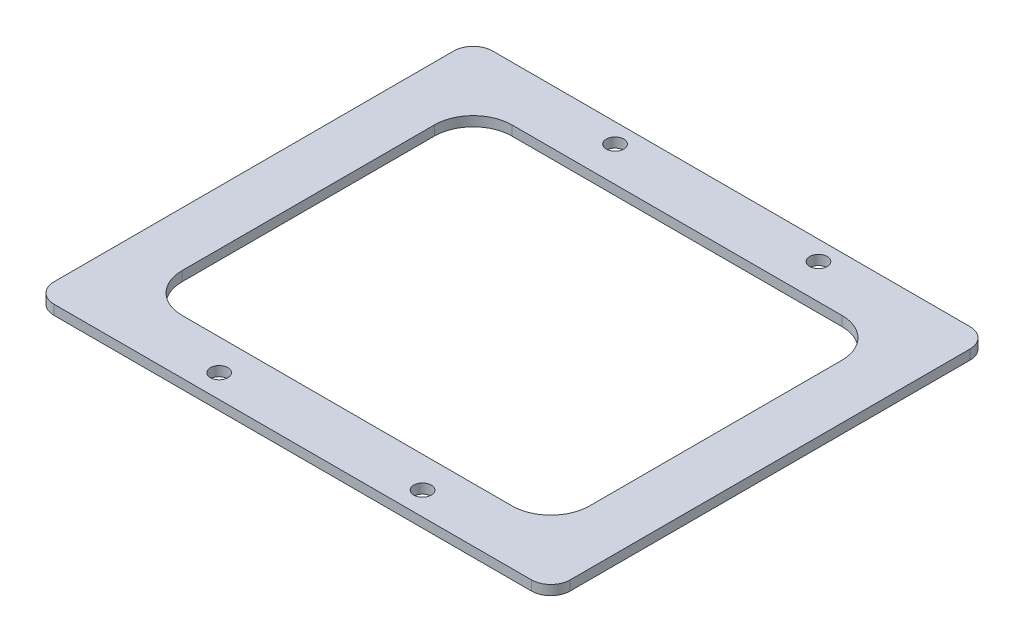
ISO-10303-21;
HEADER;
FILE_DESCRIPTION(('STEP AP214'),'2;1');
FILE_NAME('part.step','',(''),(''),'','','');
FILE_SCHEMA(('AUTOMOTIVE_DESIGN { 1 0 10303 214 1 1 1 1 }'));
ENDSEC;
DATA;
#1=APPLICATION_CONTEXT('core data for automotive mechanical design processes');
#2=APPLICATION_PROTOCOL_DEFINITION('international standard','automotive_design',2000,#1);
#3=PRODUCT_CONTEXT('',#1,'mechanical');
#4=PRODUCT('Part','Part','',(#3));
#5=PRODUCT_RELATED_PRODUCT_CATEGORY('part','',(#4));
#6=PRODUCT_DEFINITION_FORMATION('','',#4);
#7=PRODUCT_DEFINITION_CONTEXT('part definition',#1,'design');
#8=PRODUCT_DEFINITION('design','',#6,#7);
#9=PRODUCT_DEFINITION_SHAPE('','',#8);
#10=(LENGTH_UNIT() NAMED_UNIT(*) SI_UNIT(.MILLI.,.METRE.));
#11=(NAMED_UNIT(*) PLANE_ANGLE_UNIT() SI_UNIT($,.RADIAN.));
#12=(NAMED_UNIT(*) SI_UNIT($,.STERADIAN.) SOLID_ANGLE_UNIT());
#13=UNCERTAINTY_MEASURE_WITH_UNIT(LENGTH_MEASURE(1.E-05),#10,'distance_accuracy_value','');
#14=(GEOMETRIC_REPRESENTATION_CONTEXT(3) GLOBAL_UNCERTAINTY_ASSIGNED_CONTEXT((#13)) GLOBAL_UNIT_ASSIGNED_CONTEXT((#10,
#11,#12)) REPRESENTATION_CONTEXT('',''));
#15=CARTESIAN_POINT('',(0.,0.,0.));
#16=DIRECTION('',(0.,0.,1.));
#17=DIRECTION('',(1.,0.,0.));
#18=AXIS2_PLACEMENT_3D('',#15,#16,#17);
#19=CARTESIAN_POINT('',(0.,3.175,0.));
#20=DIRECTION('',(0.,-1.,0.));
#21=DIRECTION('',(0.,0.,-1.));
#22=AXIS2_PLACEMENT_3D('',#19,#20,#21);
#23=PLANE('',#22);
#24=CARTESIAN_POINT('',(34.8615,3.175,-65.405));
#25=DIRECTION('',(0.,1.,0.));
#26=DIRECTION('',(0.,0.,1.));
#27=AXIS2_PLACEMENT_3D('',#24,#25,#26);
#28=CIRCLE('',#27,2.8575);
#29=CARTESIAN_POINT('',(34.8615,3.175,-62.5475));
#30=VERTEX_POINT('',#29);
#31=EDGE_CURVE('E419',#30,#30,#28,.T.);
#32=ORIENTED_EDGE('',*,*,#31,.F.);
#33=EDGE_LOOP('',(#32));
#34=FACE_BOUND('',#33,.T.);
#35=CARTESIAN_POINT('',(-31.6865,3.175,-65.405));
#36=DIRECTION('',(0.,1.,0.));
#37=DIRECTION('',(0.,0.,1.));
#38=AXIS2_PLACEMENT_3D('',#35,#36,#37);
#39=CIRCLE('',#38,2.8575);
#40=CARTESIAN_POINT('',(-31.6865,3.175,-62.5475));
#41=VERTEX_POINT('',#40);
#42=EDGE_CURVE('E414',#41,#41,#39,.T.);
#43=ORIENTED_EDGE('',*,*,#42,.F.);
#44=EDGE_LOOP('',(#43));
#45=FACE_BOUND('',#44,.T.);
#46=DIRECTION('',(-1.,0.,0.));
#47=VECTOR('',#46,1.);
#48=CARTESIAN_POINT('',(84.455,3.175,-71.755));
#49=LINE('',#48,#47);
#50=CARTESIAN_POINT('',(78.105,3.175,-71.755));
#51=VERTEX_POINT('',#50);
#52=CARTESIAN_POINT('',(-78.105,3.175,-71.755));
#53=VERTEX_POINT('',#52);
#54=EDGE_CURVE('E381',#51,#53,#49,.T.);
#55=ORIENTED_EDGE('',*,*,#54,.T.);
#56=CARTESIAN_POINT('',(-78.105,3.175,-65.405));
#57=DIRECTION('',(0.,-1.,0.));
#58=DIRECTION('',(0.,0.,-1.));
#59=AXIS2_PLACEMENT_3D('',#56,#57,#58);
#60=CIRCLE('',#59,6.35);
#61=CARTESIAN_POINT('',(-84.455,3.175,-65.405));
#62=VERTEX_POINT('',#61);
#63=EDGE_CURVE('E199',#53,#62,#60,.F.);
#64=ORIENTED_EDGE('',*,*,#63,.T.);
#65=DIRECTION('',(0.,0.,1.));
#66=VECTOR('',#65,1.);
#67=CARTESIAN_POINT('',(-84.455,3.175,71.755));
#68=LINE('',#67,#66);
#69=CARTESIAN_POINT('',(-84.455,3.175,65.405));
#70=VERTEX_POINT('',#69);
#71=EDGE_CURVE('E168',#62,#70,#68,.T.);
#72=ORIENTED_EDGE('',*,*,#71,.T.);
#73=CARTESIAN_POINT('',(-78.105,3.175,65.405));
#74=DIRECTION('',(0.,-1.,0.));
#75=DIRECTION('',(0.,0.,-1.));
#76=AXIS2_PLACEMENT_3D('',#73,#74,#75);
#77=CIRCLE('',#76,6.35);
#78=CARTESIAN_POINT('',(-78.105,3.175,71.755));
#79=VERTEX_POINT('',#78);
#80=EDGE_CURVE('E193',#70,#79,#77,.F.);
#81=ORIENTED_EDGE('',*,*,#80,.T.);
#82=DIRECTION('',(1.,0.,0.));
#83=VECTOR('',#82,1.);
#84=CARTESIAN_POINT('',(84.455,3.175,71.755));
#85=LINE('',#84,#83);
#86=CARTESIAN_POINT('',(78.105,3.175,71.755));
#87=VERTEX_POINT('',#86);
#88=EDGE_CURVE('E175',#79,#87,#85,.T.);
#89=ORIENTED_EDGE('',*,*,#88,.T.);
#90=CARTESIAN_POINT('',(78.105,3.175,65.405));
#91=DIRECTION('',(0.,-1.,0.));
#92=DIRECTION('',(0.,0.,-1.));
#93=AXIS2_PLACEMENT_3D('',#90,#91,#92);
#94=CIRCLE('',#93,6.35);
#95=CARTESIAN_POINT('',(84.455,3.175,65.405));
#96=VERTEX_POINT('',#95);
#97=EDGE_CURVE('E195',#87,#96,#94,.F.);
#98=ORIENTED_EDGE('',*,*,#97,.T.);
#99=DIRECTION('',(0.,0.,-1.));
#100=VECTOR('',#99,1.);
#101=CARTESIAN_POINT('',(84.455,3.175,71.755));
#102=LINE('',#101,#100);
#103=CARTESIAN_POINT('',(84.455,3.175,-65.405));
#104=VERTEX_POINT('',#103);
#105=EDGE_CURVE('E179',#96,#104,#102,.T.);
#106=ORIENTED_EDGE('',*,*,#105,.T.);
#107=CARTESIAN_POINT('',(78.105,3.175,-65.405));
#108=DIRECTION('',(0.,-1.,0.));
#109=DIRECTION('',(0.,0.,-1.));
#110=AXIS2_PLACEMENT_3D('',#107,#108,#109);
#111=CIRCLE('',#110,6.35);
#112=EDGE_CURVE('E197',#104,#51,#111,.F.);
#113=ORIENTED_EDGE('',*,*,#112,.T.);
#114=EDGE_LOOP('',(#55,#64,#72,#81,#89,#98,#106,#113));
#115=FACE_BOUND('',#114,.T.);
#116=DIRECTION('',(0.,0.,1.));
#117=VECTOR('',#116,1.);
#118=CARTESIAN_POINT('',(-66.675,3.175,53.975));
#119=LINE('',#118,#117);
#120=CARTESIAN_POINT('',(-66.675,3.175,-41.275));
#121=VERTEX_POINT('',#120);
#122=CARTESIAN_POINT('',(-66.675,3.175,41.275));
#123=VERTEX_POINT('',#122);
#124=EDGE_CURVE('E360',#121,#123,#119,.T.);
#125=ORIENTED_EDGE('',*,*,#124,.F.);
#126=CARTESIAN_POINT('',(-53.975,3.175,-41.275));
#127=DIRECTION('',(0.,-1.,0.));
#128=DIRECTION('',(0.,0.,-1.));
#129=AXIS2_PLACEMENT_3D('',#126,#127,#128);
#130=CIRCLE('',#129,12.7);
#131=CARTESIAN_POINT('',(-53.975,3.175,-53.975));
#132=VERTEX_POINT('',#131);
#133=EDGE_CURVE('E48',#121,#132,#130,.T.);
#134=ORIENTED_EDGE('',*,*,#133,.T.);
#135=DIRECTION('',(-1.,0.,0.));
#136=VECTOR('',#135,1.);
#137=CARTESIAN_POINT('',(66.675,3.175,-53.975));
#138=LINE('',#137,#136);
#139=CARTESIAN_POINT('',(53.975,3.175,-53.975));
#140=VERTEX_POINT('',#139);
#141=EDGE_CURVE('E387',#140,#132,#138,.T.);
#142=ORIENTED_EDGE('',*,*,#141,.F.);
#143=CARTESIAN_POINT('',(53.975,3.175,-41.275));
#144=DIRECTION('',(0.,-1.,0.));
#145=DIRECTION('',(0.,0.,-1.));
#146=AXIS2_PLACEMENT_3D('',#143,#144,#145);
#147=CIRCLE('',#146,12.7);
#148=CARTESIAN_POINT('',(66.675,3.175,-41.275));
#149=VERTEX_POINT('',#148);
#150=EDGE_CURVE('E243',#140,#149,#147,.T.);
#151=ORIENTED_EDGE('',*,*,#150,.T.);
#152=DIRECTION('',(0.,0.,-1.));
#153=VECTOR('',#152,1.);
#154=CARTESIAN_POINT('',(66.675,3.175,53.975));
#155=LINE('',#154,#153);
#156=CARTESIAN_POINT('',(66.675,3.175,41.275));
#157=VERTEX_POINT('',#156);
#158=EDGE_CURVE('E359',#157,#149,#155,.T.);
#159=ORIENTED_EDGE('',*,*,#158,.F.);
#160=CARTESIAN_POINT('',(53.975,3.175,41.275));
#161=DIRECTION('',(0.,-1.,0.));
#162=DIRECTION('',(0.,0.,-1.));
#163=AXIS2_PLACEMENT_3D('',#160,#161,#162);
#164=CIRCLE('',#163,12.7);
#165=CARTESIAN_POINT('',(53.975,3.175,53.975));
#166=VERTEX_POINT('',#165);
#167=EDGE_CURVE('E232',#157,#166,#164,.T.);
#168=ORIENTED_EDGE('',*,*,#167,.T.);
#169=DIRECTION('',(1.,0.,0.));
#170=VECTOR('',#169,1.);
#171=CARTESIAN_POINT('',(66.675,3.175,53.975));
#172=LINE('',#171,#170);
#173=CARTESIAN_POINT('',(-53.975,3.175,53.975));
#174=VERTEX_POINT('',#173);
#175=EDGE_CURVE('E353',#174,#166,#172,.T.);
#176=ORIENTED_EDGE('',*,*,#175,.F.);
#177=CARTESIAN_POINT('',(-53.975,3.175,41.275));
#178=DIRECTION('',(0.,-1.,0.));
#179=DIRECTION('',(0.,0.,-1.));
#180=AXIS2_PLACEMENT_3D('',#177,#178,#179);
#181=CIRCLE('',#180,12.7);
#182=EDGE_CURVE('E236',#174,#123,#181,.T.);
#183=ORIENTED_EDGE('',*,*,#182,.T.);
#184=EDGE_LOOP('',(#125,#134,#142,#151,#159,#168,#176,#183));
#185=FACE_BOUND('',#184,.T.);
#186=CARTESIAN_POINT('',(-31.6865,3.175,64.135));
#187=DIRECTION('',(0.,1.,0.));
#188=DIRECTION('',(0.,0.,1.));
#189=AXIS2_PLACEMENT_3D('',#186,#187,#188);
#190=CIRCLE('',#189,2.8575);
#191=CARTESIAN_POINT('',(-31.6865,3.175,66.9925));
#192=VERTEX_POINT('',#191);
#193=EDGE_CURVE('E248',#192,#192,#190,.T.);
#194=ORIENTED_EDGE('',*,*,#193,.F.);
#195=EDGE_LOOP('',(#194));
#196=FACE_BOUND('',#195,.T.);
#197=CARTESIAN_POINT('',(34.8615,3.175,64.135));
#198=DIRECTION('',(0.,1.,0.));
#199=DIRECTION('',(0.,0.,1.));
#200=AXIS2_PLACEMENT_3D('',#197,#198,#199);
#201=CIRCLE('',#200,2.8575);
#202=CARTESIAN_POINT('',(34.8615,3.175,66.9925));
#203=VERTEX_POINT('',#202);
#204=EDGE_CURVE('E11',#203,#203,#201,.T.);
#205=ORIENTED_EDGE('',*,*,#204,.F.);
#206=EDGE_LOOP('',(#205));
#207=FACE_BOUND('',#206,.T.);
#208=ADVANCED_FACE('F33',(#34,#45,#115,#185,#196,#207),#23,.F.);
#209=CARTESIAN_POINT('',(0.,0.,0.));
#210=DIRECTION('',(0.,-1.,0.));
#211=DIRECTION('',(0.,0.,-1.));
#212=AXIS2_PLACEMENT_3D('',#209,#210,#211);
#213=PLANE('',#212);
#214=CARTESIAN_POINT('',(34.8615,0.,-65.405));
#215=DIRECTION('',(0.,1.,0.));
#216=DIRECTION('',(0.,0.,1.));
#217=AXIS2_PLACEMENT_3D('',#214,#215,#216);
#218=CIRCLE('',#217,2.8575);
#219=CARTESIAN_POINT('',(34.8615,0.,-62.5475));
#220=VERTEX_POINT('',#219);
#221=EDGE_CURVE('E424',#220,#220,#218,.T.);
#222=ORIENTED_EDGE('',*,*,#221,.T.);
#223=EDGE_LOOP('',(#222));
#224=FACE_BOUND('',#223,.T.);
#225=CARTESIAN_POINT('',(-31.6865,0.,-65.405));
#226=DIRECTION('',(0.,1.,0.));
#227=DIRECTION('',(0.,0.,1.));
#228=AXIS2_PLACEMENT_3D('',#225,#226,#227);
#229=CIRCLE('',#228,2.8575);
#230=CARTESIAN_POINT('',(-31.6865,0.,-62.5475));
#231=VERTEX_POINT('',#230);
#232=EDGE_CURVE('E412',#231,#231,#229,.T.);
#233=ORIENTED_EDGE('',*,*,#232,.T.);
#234=EDGE_LOOP('',(#233));
#235=FACE_BOUND('',#234,.T.);
#236=DIRECTION('',(0.,0.,1.));
#237=VECTOR('',#236,1.);
#238=CARTESIAN_POINT('',(-84.455,0.,71.755));
#239=LINE('',#238,#237);
#240=CARTESIAN_POINT('',(-84.455,0.,-65.405));
#241=VERTEX_POINT('',#240);
#242=CARTESIAN_POINT('',(-84.455,0.,65.405));
#243=VERTEX_POINT('',#242);
#244=EDGE_CURVE('E165',#241,#243,#239,.T.);
#245=ORIENTED_EDGE('',*,*,#244,.F.);
#246=CARTESIAN_POINT('',(-78.105,0.,-65.405));
#247=DIRECTION('',(0.,-1.,0.));
#248=DIRECTION('',(0.,0.,-1.));
#249=AXIS2_PLACEMENT_3D('',#246,#247,#248);
#250=CIRCLE('',#249,6.35);
#251=CARTESIAN_POINT('',(-78.105,0.,-71.755));
#252=VERTEX_POINT('',#251);
#253=EDGE_CURVE('E148',#241,#252,#250,.T.);
#254=ORIENTED_EDGE('',*,*,#253,.T.);
#255=DIRECTION('',(-1.,0.,0.));
#256=VECTOR('',#255,1.);
#257=CARTESIAN_POINT('',(84.455,0.,-71.755));
#258=LINE('',#257,#256);
#259=CARTESIAN_POINT('',(78.105,0.,-71.755));
#260=VERTEX_POINT('',#259);
#261=EDGE_CURVE('E176',#260,#252,#258,.T.);
#262=ORIENTED_EDGE('',*,*,#261,.F.);
#263=CARTESIAN_POINT('',(78.105,0.,-65.405));
#264=DIRECTION('',(0.,-1.,0.));
#265=DIRECTION('',(0.,0.,-1.));
#266=AXIS2_PLACEMENT_3D('',#263,#264,#265);
#267=CIRCLE('',#266,6.35);
#268=CARTESIAN_POINT('',(84.455,0.,-65.405));
#269=VERTEX_POINT('',#268);
#270=EDGE_CURVE('E159',#260,#269,#267,.T.);
#271=ORIENTED_EDGE('',*,*,#270,.T.);
#272=DIRECTION('',(0.,0.,-1.));
#273=VECTOR('',#272,1.);
#274=CARTESIAN_POINT('',(84.455,0.,71.755));
#275=LINE('',#274,#273);
#276=CARTESIAN_POINT('',(84.455,0.,65.405));
#277=VERTEX_POINT('',#276);
#278=EDGE_CURVE('E181',#277,#269,#275,.T.);
#279=ORIENTED_EDGE('',*,*,#278,.F.);
#280=CARTESIAN_POINT('',(78.105,0.,65.405));
#281=DIRECTION('',(0.,-1.,0.));
#282=DIRECTION('',(0.,0.,-1.));
#283=AXIS2_PLACEMENT_3D('',#280,#281,#282);
#284=CIRCLE('',#283,6.35);
#285=CARTESIAN_POINT('',(78.105,0.,71.755));
#286=VERTEX_POINT('',#285);
#287=EDGE_CURVE('E187',#277,#286,#284,.T.);
#288=ORIENTED_EDGE('',*,*,#287,.T.);
#289=DIRECTION('',(1.,0.,0.));
#290=VECTOR('',#289,1.);
#291=CARTESIAN_POINT('',(84.455,0.,71.755));
#292=LINE('',#291,#290);
#293=CARTESIAN_POINT('',(-78.105,0.,71.755));
#294=VERTEX_POINT('',#293);
#295=EDGE_CURVE('E385',#294,#286,#292,.T.);
#296=ORIENTED_EDGE('',*,*,#295,.F.);
#297=CARTESIAN_POINT('',(-78.105,0.,65.405));
#298=DIRECTION('',(0.,-1.,0.));
#299=DIRECTION('',(0.,0.,-1.));
#300=AXIS2_PLACEMENT_3D('',#297,#298,#299);
#301=CIRCLE('',#300,6.35);
#302=EDGE_CURVE('E169',#294,#243,#301,.T.);
#303=ORIENTED_EDGE('',*,*,#302,.T.);
#304=EDGE_LOOP('',(#245,#254,#262,#271,#279,#288,#296,#303));
#305=FACE_BOUND('',#304,.T.);
#306=DIRECTION('',(0.,0.,-1.));
#307=VECTOR('',#306,1.);
#308=CARTESIAN_POINT('',(66.675,0.,53.975));
#309=LINE('',#308,#307);
#310=CARTESIAN_POINT('',(66.675,0.,41.275));
#311=VERTEX_POINT('',#310);
#312=CARTESIAN_POINT('',(66.675,0.,-41.275));
#313=VERTEX_POINT('',#312);
#314=EDGE_CURVE('E366',#311,#313,#309,.T.);
#315=ORIENTED_EDGE('',*,*,#314,.T.);
#316=CARTESIAN_POINT('',(53.975,0.,-41.275));
#317=DIRECTION('',(0.,-1.,0.));
#318=DIRECTION('',(0.,0.,-1.));
#319=AXIS2_PLACEMENT_3D('',#316,#317,#318);
#320=CIRCLE('',#319,12.7);
#321=CARTESIAN_POINT('',(53.975,0.,-53.975));
#322=VERTEX_POINT('',#321);
#323=EDGE_CURVE('E241',#313,#322,#320,.F.);
#324=ORIENTED_EDGE('',*,*,#323,.T.);
#325=DIRECTION('',(-1.,0.,0.));
#326=VECTOR('',#325,1.);
#327=CARTESIAN_POINT('',(66.675,0.,-53.975));
#328=LINE('',#327,#326);
#329=CARTESIAN_POINT('',(-53.975,0.,-53.975));
#330=VERTEX_POINT('',#329);
#331=EDGE_CURVE('E371',#322,#330,#328,.T.);
#332=ORIENTED_EDGE('',*,*,#331,.T.);
#333=CARTESIAN_POINT('',(-53.975,0.,-41.275));
#334=DIRECTION('',(0.,-1.,0.));
#335=DIRECTION('',(0.,0.,-1.));
#336=AXIS2_PLACEMENT_3D('',#333,#334,#335);
#337=CIRCLE('',#336,12.7);
#338=CARTESIAN_POINT('',(-66.675,0.,-41.275));
#339=VERTEX_POINT('',#338);
#340=EDGE_CURVE('E238',#330,#339,#337,.F.);
#341=ORIENTED_EDGE('',*,*,#340,.T.);
#342=DIRECTION('',(0.,0.,1.));
#343=VECTOR('',#342,1.);
#344=CARTESIAN_POINT('',(-66.675,0.,53.975));
#345=LINE('',#344,#343);
#346=CARTESIAN_POINT('',(-66.675,0.,41.275));
#347=VERTEX_POINT('',#346);
#348=EDGE_CURVE('E375',#339,#347,#345,.T.);
#349=ORIENTED_EDGE('',*,*,#348,.T.);
#350=CARTESIAN_POINT('',(-53.975,0.,41.275));
#351=DIRECTION('',(0.,-1.,0.));
#352=DIRECTION('',(0.,0.,-1.));
#353=AXIS2_PLACEMENT_3D('',#350,#351,#352);
#354=CIRCLE('',#353,12.7);
#355=CARTESIAN_POINT('',(-53.975,0.,53.975));
#356=VERTEX_POINT('',#355);
#357=EDGE_CURVE('E234',#347,#356,#354,.F.);
#358=ORIENTED_EDGE('',*,*,#357,.T.);
#359=DIRECTION('',(1.,0.,0.));
#360=VECTOR('',#359,1.);
#361=CARTESIAN_POINT('',(66.675,0.,53.975));
#362=LINE('',#361,#360);
#363=CARTESIAN_POINT('',(53.975,0.,53.975));
#364=VERTEX_POINT('',#363);
#365=EDGE_CURVE('E367',#356,#364,#362,.T.);
#366=ORIENTED_EDGE('',*,*,#365,.T.);
#367=CARTESIAN_POINT('',(53.975,0.,41.275));
#368=DIRECTION('',(0.,-1.,0.));
#369=DIRECTION('',(0.,0.,-1.));
#370=AXIS2_PLACEMENT_3D('',#367,#368,#369);
#371=CIRCLE('',#370,12.7);
#372=EDGE_CURVE('E230',#364,#311,#371,.F.);
#373=ORIENTED_EDGE('',*,*,#372,.T.);
#374=EDGE_LOOP('',(#315,#324,#332,#341,#349,#358,#366,#373));
#375=FACE_BOUND('',#374,.T.);
#376=CARTESIAN_POINT('',(-31.6865,0.,64.135));
#377=DIRECTION('',(0.,1.,0.));
#378=DIRECTION('',(0.,0.,1.));
#379=AXIS2_PLACEMENT_3D('',#376,#377,#378);
#380=CIRCLE('',#379,2.8575);
#381=CARTESIAN_POINT('',(-31.6865,0.,66.9925));
#382=VERTEX_POINT('',#381);
#383=EDGE_CURVE('E245',#382,#382,#380,.T.);
#384=ORIENTED_EDGE('',*,*,#383,.T.);
#385=EDGE_LOOP('',(#384));
#386=FACE_BOUND('',#385,.T.);
#387=CARTESIAN_POINT('',(34.8615,0.,64.135));
#388=DIRECTION('',(0.,1.,0.));
#389=DIRECTION('',(0.,0.,1.));
#390=AXIS2_PLACEMENT_3D('',#387,#388,#389);
#391=CIRCLE('',#390,2.8575);
#392=CARTESIAN_POINT('',(34.8615,0.,66.9925));
#393=VERTEX_POINT('',#392);
#394=EDGE_CURVE('E41',#393,#393,#391,.T.);
#395=ORIENTED_EDGE('',*,*,#394,.T.);
#396=EDGE_LOOP('',(#395));
#397=FACE_BOUND('',#396,.T.);
#398=ADVANCED_FACE('F172',(#224,#235,#305,#375,#386,#397),#213,.T.);
#399=CARTESIAN_POINT('',(84.455,3.175,71.755));
#400=DIRECTION('',(0.,0.,-1.));
#401=DIRECTION('',(-1.,0.,0.));
#402=AXIS2_PLACEMENT_3D('',#399,#400,#401);
#403=PLANE('',#402);
#404=ORIENTED_EDGE('',*,*,#295,.T.);
#405=DIRECTION('',(0.,-1.,0.));
#406=VECTOR('',#405,1.);
#407=CARTESIAN_POINT('',(78.105,3.175,71.755));
#408=LINE('',#407,#406);
#409=EDGE_CURVE('E209',#286,#87,#408,.F.);
#410=ORIENTED_EDGE('',*,*,#409,.T.);
#411=ORIENTED_EDGE('',*,*,#88,.F.);
#412=DIRECTION('',(0.,-1.,0.));
#413=VECTOR('',#412,1.);
#414=CARTESIAN_POINT('',(-78.105,3.175,71.755));
#415=LINE('',#414,#413);
#416=EDGE_CURVE('E206',#79,#294,#415,.T.);
#417=ORIENTED_EDGE('',*,*,#416,.T.);
#418=EDGE_LOOP('',(#404,#410,#411,#417));
#419=FACE_BOUND('',#418,.T.);
#420=ADVANCED_FACE('F265',(#419),#403,.F.);
#421=CARTESIAN_POINT('',(84.455,3.175,71.755));
#422=DIRECTION('',(-1.,0.,0.));
#423=DIRECTION('',(0.,0.,1.));
#424=AXIS2_PLACEMENT_3D('',#421,#422,#423);
#425=PLANE('',#424);
#426=ORIENTED_EDGE('',*,*,#278,.T.);
#427=DIRECTION('',(0.,-1.,0.));
#428=VECTOR('',#427,1.);
#429=CARTESIAN_POINT('',(84.455,3.175,-65.405));
#430=LINE('',#429,#428);
#431=EDGE_CURVE('E204',#269,#104,#430,.F.);
#432=ORIENTED_EDGE('',*,*,#431,.T.);
#433=ORIENTED_EDGE('',*,*,#105,.F.);
#434=DIRECTION('',(0.,-1.,0.));
#435=VECTOR('',#434,1.);
#436=CARTESIAN_POINT('',(84.455,3.175,65.405));
#437=LINE('',#436,#435);
#438=EDGE_CURVE('E201',#96,#277,#437,.T.);
#439=ORIENTED_EDGE('',*,*,#438,.T.);
#440=EDGE_LOOP('',(#426,#432,#433,#439));
#441=FACE_BOUND('',#440,.T.);
#442=ADVANCED_FACE('F279',(#441),#425,.F.);
#443=CARTESIAN_POINT('',(84.455,3.175,-71.755));
#444=DIRECTION('',(0.,0.,1.));
#445=DIRECTION('',(1.,0.,0.));
#446=AXIS2_PLACEMENT_3D('',#443,#444,#445);
#447=PLANE('',#446);
#448=ORIENTED_EDGE('',*,*,#261,.T.);
#449=DIRECTION('',(0.,-1.,0.));
#450=VECTOR('',#449,1.);
#451=CARTESIAN_POINT('',(-78.105,3.175,-71.755));
#452=LINE('',#451,#450);
#453=EDGE_CURVE('E153',#252,#53,#452,.F.);
#454=ORIENTED_EDGE('',*,*,#453,.T.);
#455=ORIENTED_EDGE('',*,*,#54,.F.);
#456=DIRECTION('',(0.,-1.,0.));
#457=VECTOR('',#456,1.);
#458=CARTESIAN_POINT('',(78.105,3.175,-71.755));
#459=LINE('',#458,#457);
#460=EDGE_CURVE('E158',#51,#260,#459,.T.);
#461=ORIENTED_EDGE('',*,*,#460,.T.);
#462=EDGE_LOOP('',(#448,#454,#455,#461));
#463=FACE_BOUND('',#462,.T.);
#464=ADVANCED_FACE('F276',(#463),#447,.F.);
#465=CARTESIAN_POINT('',(-84.455,3.175,71.755));
#466=DIRECTION('',(1.,0.,0.));
#467=DIRECTION('',(0.,0.,-1.));
#468=AXIS2_PLACEMENT_3D('',#465,#466,#467);
#469=PLANE('',#468);
#470=ORIENTED_EDGE('',*,*,#71,.F.);
#471=DIRECTION('',(0.,-1.,0.));
#472=VECTOR('',#471,1.);
#473=CARTESIAN_POINT('',(-84.455,3.175,-65.405));
#474=LINE('',#473,#472);
#475=EDGE_CURVE('E152',#62,#241,#474,.T.);
#476=ORIENTED_EDGE('',*,*,#475,.T.);
#477=ORIENTED_EDGE('',*,*,#244,.T.);
#478=DIRECTION('',(0.,-1.,0.));
#479=VECTOR('',#478,1.);
#480=CARTESIAN_POINT('',(-84.455,3.175,65.405));
#481=LINE('',#480,#479);
#482=EDGE_CURVE('E170',#243,#70,#481,.F.);
#483=ORIENTED_EDGE('',*,*,#482,.T.);
#484=EDGE_LOOP('',(#470,#476,#477,#483));
#485=FACE_BOUND('',#484,.T.);
#486=ADVANCED_FACE('F164',(#485),#469,.F.);
#487=CARTESIAN_POINT('',(-66.675,3.175,53.975));
#488=DIRECTION('',(1.,0.,0.));
#489=DIRECTION('',(0.,0.,-1.));
#490=AXIS2_PLACEMENT_3D('',#487,#488,#489);
#491=PLANE('',#490);
#492=ORIENTED_EDGE('',*,*,#124,.T.);
#493=DIRECTION('',(0.,-1.,0.));
#494=VECTOR('',#493,1.);
#495=CARTESIAN_POINT('',(-66.675,0.,41.275));
#496=LINE('',#495,#494);
#497=EDGE_CURVE('E223',#123,#347,#496,.T.);
#498=ORIENTED_EDGE('',*,*,#497,.T.);
#499=ORIENTED_EDGE('',*,*,#348,.F.);
#500=DIRECTION('',(0.,-1.,0.));
#501=VECTOR('',#500,1.);
#502=CARTESIAN_POINT('',(-66.675,3.175,-41.275));
#503=LINE('',#502,#501);
#504=EDGE_CURVE('E221',#339,#121,#503,.F.);
#505=ORIENTED_EDGE('',*,*,#504,.T.);
#506=EDGE_LOOP('',(#492,#498,#499,#505));
#507=FACE_BOUND('',#506,.T.);
#508=ADVANCED_FACE('F271',(#507),#491,.T.);
#509=CARTESIAN_POINT('',(66.675,3.175,53.975));
#510=DIRECTION('',(0.,0.,-1.));
#511=DIRECTION('',(-1.,0.,0.));
#512=AXIS2_PLACEMENT_3D('',#509,#510,#511);
#513=PLANE('',#512);
#514=ORIENTED_EDGE('',*,*,#175,.T.);
#515=DIRECTION('',(0.,-1.,0.));
#516=VECTOR('',#515,1.);
#517=CARTESIAN_POINT('',(53.975,0.,53.975));
#518=LINE('',#517,#516);
#519=EDGE_CURVE('E213',#166,#364,#518,.T.);
#520=ORIENTED_EDGE('',*,*,#519,.T.);
#521=ORIENTED_EDGE('',*,*,#365,.F.);
#522=DIRECTION('',(0.,-1.,0.));
#523=VECTOR('',#522,1.);
#524=CARTESIAN_POINT('',(-53.975,3.175,53.975));
#525=LINE('',#524,#523);
#526=EDGE_CURVE('E211',#356,#174,#525,.F.);
#527=ORIENTED_EDGE('',*,*,#526,.T.);
#528=EDGE_LOOP('',(#514,#520,#521,#527));
#529=FACE_BOUND('',#528,.T.);
#530=ADVANCED_FACE('F343',(#529),#513,.T.);
#531=CARTESIAN_POINT('',(66.675,3.175,53.975));
#532=DIRECTION('',(-1.,0.,0.));
#533=DIRECTION('',(0.,0.,1.));
#534=AXIS2_PLACEMENT_3D('',#531,#532,#533);
#535=PLANE('',#534);
#536=ORIENTED_EDGE('',*,*,#314,.F.);
#537=DIRECTION('',(0.,-1.,0.));
#538=VECTOR('',#537,1.);
#539=CARTESIAN_POINT('',(66.675,3.175,41.275));
#540=LINE('',#539,#538);
#541=EDGE_CURVE('E219',#311,#157,#540,.F.);
#542=ORIENTED_EDGE('',*,*,#541,.T.);
#543=ORIENTED_EDGE('',*,*,#158,.T.);
#544=DIRECTION('',(0.,-1.,0.));
#545=VECTOR('',#544,1.);
#546=CARTESIAN_POINT('',(66.675,0.,-41.275));
#547=LINE('',#546,#545);
#548=EDGE_CURVE('E216',#149,#313,#547,.T.);
#549=ORIENTED_EDGE('',*,*,#548,.T.);
#550=EDGE_LOOP('',(#536,#542,#543,#549));
#551=FACE_BOUND('',#550,.T.);
#552=ADVANCED_FACE('F341',(#551),#535,.T.);
#553=CARTESIAN_POINT('',(66.675,3.175,-53.975));
#554=DIRECTION('',(0.,0.,1.));
#555=DIRECTION('',(1.,0.,0.));
#556=AXIS2_PLACEMENT_3D('',#553,#554,#555);
#557=PLANE('',#556);
#558=ORIENTED_EDGE('',*,*,#141,.T.);
#559=DIRECTION('',(0.,-1.,0.));
#560=VECTOR('',#559,1.);
#561=CARTESIAN_POINT('',(-53.975,0.,-53.975));
#562=LINE('',#561,#560);
#563=EDGE_CURVE('E227',#132,#330,#562,.T.);
#564=ORIENTED_EDGE('',*,*,#563,.T.);
#565=ORIENTED_EDGE('',*,*,#331,.F.);
#566=DIRECTION('',(0.,-1.,0.));
#567=VECTOR('',#566,1.);
#568=CARTESIAN_POINT('',(53.975,3.175,-53.975));
#569=LINE('',#568,#567);
#570=EDGE_CURVE('E55',#322,#140,#569,.F.);
#571=ORIENTED_EDGE('',*,*,#570,.T.);
#572=EDGE_LOOP('',(#558,#564,#565,#571));
#573=FACE_BOUND('',#572,.T.);
#574=ADVANCED_FACE('F290',(#573),#557,.T.);
#575=CARTESIAN_POINT('',(-78.105,3.175,-65.405));
#576=DIRECTION('',(0.,-1.,0.));
#577=DIRECTION('',(0.,0.,-1.));
#578=AXIS2_PLACEMENT_3D('',#575,#576,#577);
#579=CYLINDRICAL_SURFACE('',#578,6.35);
#580=ORIENTED_EDGE('',*,*,#63,.F.);
#581=ORIENTED_EDGE('',*,*,#453,.F.);
#582=ORIENTED_EDGE('',*,*,#253,.F.);
#583=ORIENTED_EDGE('',*,*,#475,.F.);
#584=EDGE_LOOP('',(#580,#581,#582,#583));
#585=FACE_BOUND('',#584,.T.);
#586=ADVANCED_FACE('F151',(#585),#579,.T.);
#587=CARTESIAN_POINT('',(78.105,3.175,-65.405));
#588=DIRECTION('',(0.,-1.,0.));
#589=DIRECTION('',(0.,0.,-1.));
#590=AXIS2_PLACEMENT_3D('',#587,#588,#589);
#591=CYLINDRICAL_SURFACE('',#590,6.35);
#592=ORIENTED_EDGE('',*,*,#112,.F.);
#593=ORIENTED_EDGE('',*,*,#431,.F.);
#594=ORIENTED_EDGE('',*,*,#270,.F.);
#595=ORIENTED_EDGE('',*,*,#460,.F.);
#596=EDGE_LOOP('',(#592,#593,#594,#595));
#597=FACE_BOUND('',#596,.T.);
#598=ADVANCED_FACE('F289',(#597),#591,.T.);
#599=CARTESIAN_POINT('',(78.105,3.175,65.405));
#600=DIRECTION('',(0.,-1.,0.));
#601=DIRECTION('',(0.,0.,-1.));
#602=AXIS2_PLACEMENT_3D('',#599,#600,#601);
#603=CYLINDRICAL_SURFACE('',#602,6.35);
#604=ORIENTED_EDGE('',*,*,#97,.F.);
#605=ORIENTED_EDGE('',*,*,#409,.F.);
#606=ORIENTED_EDGE('',*,*,#287,.F.);
#607=ORIENTED_EDGE('',*,*,#438,.F.);
#608=EDGE_LOOP('',(#604,#605,#606,#607));
#609=FACE_BOUND('',#608,.T.);
#610=ADVANCED_FACE('F293',(#609),#603,.T.);
#611=CARTESIAN_POINT('',(-78.105,3.175,65.405));
#612=DIRECTION('',(0.,-1.,0.));
#613=DIRECTION('',(0.,0.,-1.));
#614=AXIS2_PLACEMENT_3D('',#611,#612,#613);
#615=CYLINDRICAL_SURFACE('',#614,6.35);
#616=ORIENTED_EDGE('',*,*,#80,.F.);
#617=ORIENTED_EDGE('',*,*,#482,.F.);
#618=ORIENTED_EDGE('',*,*,#302,.F.);
#619=ORIENTED_EDGE('',*,*,#416,.F.);
#620=EDGE_LOOP('',(#616,#617,#618,#619));
#621=FACE_BOUND('',#620,.T.);
#622=ADVANCED_FACE('F297',(#621),#615,.T.);
#623=CARTESIAN_POINT('',(53.975,3.175,41.275));
#624=DIRECTION('',(0.,1.,0.));
#625=DIRECTION('',(0.,0.,1.));
#626=AXIS2_PLACEMENT_3D('',#623,#624,#625);
#627=CYLINDRICAL_SURFACE('',#626,12.7);
#628=ORIENTED_EDGE('',*,*,#167,.F.);
#629=ORIENTED_EDGE('',*,*,#541,.F.);
#630=ORIENTED_EDGE('',*,*,#372,.F.);
#631=ORIENTED_EDGE('',*,*,#519,.F.);
#632=EDGE_LOOP('',(#628,#629,#630,#631));
#633=FACE_BOUND('',#632,.T.);
#634=ADVANCED_FACE('F301',(#633),#627,.F.);
#635=CARTESIAN_POINT('',(-53.975,3.175,41.275));
#636=DIRECTION('',(0.,1.,0.));
#637=DIRECTION('',(0.,0.,1.));
#638=AXIS2_PLACEMENT_3D('',#635,#636,#637);
#639=CYLINDRICAL_SURFACE('',#638,12.7);
#640=ORIENTED_EDGE('',*,*,#182,.F.);
#641=ORIENTED_EDGE('',*,*,#526,.F.);
#642=ORIENTED_EDGE('',*,*,#357,.F.);
#643=ORIENTED_EDGE('',*,*,#497,.F.);
#644=EDGE_LOOP('',(#640,#641,#642,#643));
#645=FACE_BOUND('',#644,.T.);
#646=ADVANCED_FACE('F305',(#645),#639,.F.);
#647=CARTESIAN_POINT('',(-53.975,3.175,-41.275));
#648=DIRECTION('',(0.,1.,0.));
#649=DIRECTION('',(0.,0.,1.));
#650=AXIS2_PLACEMENT_3D('',#647,#648,#649);
#651=CYLINDRICAL_SURFACE('',#650,12.7);
#652=ORIENTED_EDGE('',*,*,#133,.F.);
#653=ORIENTED_EDGE('',*,*,#504,.F.);
#654=ORIENTED_EDGE('',*,*,#340,.F.);
#655=ORIENTED_EDGE('',*,*,#563,.F.);
#656=EDGE_LOOP('',(#652,#653,#654,#655));
#657=FACE_BOUND('',#656,.T.);
#658=ADVANCED_FACE('F309',(#657),#651,.F.);
#659=CARTESIAN_POINT('',(53.975,3.175,-41.275));
#660=DIRECTION('',(0.,1.,0.));
#661=DIRECTION('',(0.,0.,1.));
#662=AXIS2_PLACEMENT_3D('',#659,#660,#661);
#663=CYLINDRICAL_SURFACE('',#662,12.7);
#664=ORIENTED_EDGE('',*,*,#150,.F.);
#665=ORIENTED_EDGE('',*,*,#570,.F.);
#666=ORIENTED_EDGE('',*,*,#323,.F.);
#667=ORIENTED_EDGE('',*,*,#548,.F.);
#668=EDGE_LOOP('',(#664,#665,#666,#667));
#669=FACE_BOUND('',#668,.T.);
#670=ADVANCED_FACE('F313',(#669),#663,.F.);
#671=CARTESIAN_POINT('',(-31.6865,0.,-65.405));
#672=DIRECTION('',(0.,1.,0.));
#673=DIRECTION('',(0.,0.,1.));
#674=AXIS2_PLACEMENT_3D('',#671,#672,#673);
#675=CYLINDRICAL_SURFACE('',#674,2.8575);
#676=ORIENTED_EDGE('',*,*,#232,.F.);
#677=EDGE_LOOP('',(#676));
#678=FACE_BOUND('',#677,.T.);
#679=ORIENTED_EDGE('',*,*,#42,.T.);
#680=EDGE_LOOP('',(#679));
#681=FACE_BOUND('',#680,.T.);
#682=ADVANCED_FACE('F316',(#678,#681),#675,.F.);
#683=CARTESIAN_POINT('',(34.8615,0.,-65.405));
#684=DIRECTION('',(0.,1.,0.));
#685=DIRECTION('',(0.,0.,1.));
#686=AXIS2_PLACEMENT_3D('',#683,#684,#685);
#687=CYLINDRICAL_SURFACE('',#686,2.8575);
#688=ORIENTED_EDGE('',*,*,#221,.F.);
#689=EDGE_LOOP('',(#688));
#690=FACE_BOUND('',#689,.T.);
#691=ORIENTED_EDGE('',*,*,#31,.T.);
#692=EDGE_LOOP('',(#691));
#693=FACE_BOUND('',#692,.T.);
#694=ADVANCED_FACE('F319',(#690,#693),#687,.F.);
#695=CARTESIAN_POINT('',(-31.6865,0.,64.135));
#696=DIRECTION('',(0.,1.,0.));
#697=DIRECTION('',(0.,0.,1.));
#698=AXIS2_PLACEMENT_3D('',#695,#696,#697);
#699=CYLINDRICAL_SURFACE('',#698,2.8575);
#700=ORIENTED_EDGE('',*,*,#383,.F.);
#701=EDGE_LOOP('',(#700));
#702=FACE_BOUND('',#701,.T.);
#703=ORIENTED_EDGE('',*,*,#193,.T.);
#704=EDGE_LOOP('',(#703));
#705=FACE_BOUND('',#704,.T.);
#706=ADVANCED_FACE('F256',(#702,#705),#699,.F.);
#707=CARTESIAN_POINT('',(34.8615,0.,64.135));
#708=DIRECTION('',(0.,1.,0.));
#709=DIRECTION('',(0.,0.,1.));
#710=AXIS2_PLACEMENT_3D('',#707,#708,#709);
#711=CYLINDRICAL_SURFACE('',#710,2.8575);
#712=ORIENTED_EDGE('',*,*,#394,.F.);
#713=EDGE_LOOP('',(#712));
#714=FACE_BOUND('',#713,.T.);
#715=ORIENTED_EDGE('',*,*,#204,.T.);
#716=EDGE_LOOP('',(#715));
#717=FACE_BOUND('',#716,.T.);
#718=ADVANCED_FACE('F35',(#714,#717),#711,.F.);
#719=CLOSED_SHELL('',(#208,#398,#420,#442,#464,#486,#508,#530,#552,#574,#586,#598,#610,#622,
#634,#646,#658,#670,#682,#694,#706,#718));
#720=MANIFOLD_SOLID_BREP('B2',#719);
#721=ADVANCED_BREP_SHAPE_REPRESENTATION('',(#18,#720),#14);
#722=SHAPE_DEFINITION_REPRESENTATION(#9,#721);
ENDSEC;
END-ISO-10303-21;
